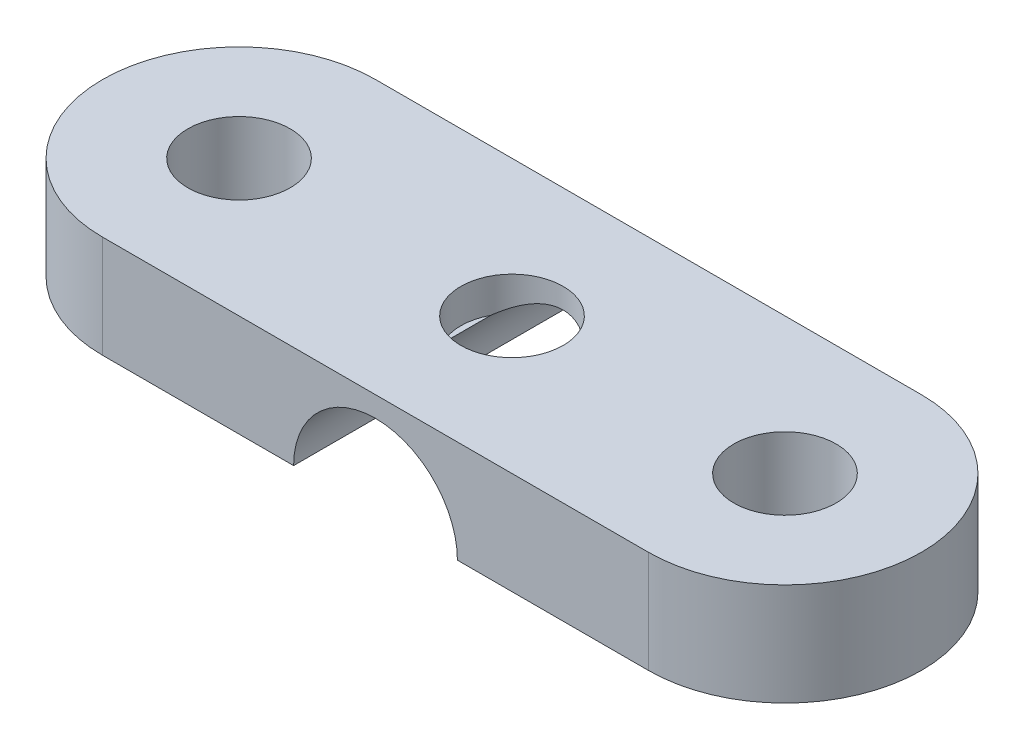
ISO-10303-21;
HEADER;
FILE_DESCRIPTION(('STEP AP214'),'2;1');
FILE_NAME('part.step','',(''),(''),'','','');
FILE_SCHEMA(('AUTOMOTIVE_DESIGN { 1 0 10303 214 1 1 1 1 }'));
ENDSEC;
DATA;
#1=APPLICATION_CONTEXT('core data for automotive mechanical design processes');
#2=APPLICATION_PROTOCOL_DEFINITION('international standard','automotive_design',2000,#1);
#3=PRODUCT_CONTEXT('',#1,'mechanical');
#4=PRODUCT('Part','Part','',(#3));
#5=PRODUCT_RELATED_PRODUCT_CATEGORY('part','',(#4));
#6=PRODUCT_DEFINITION_FORMATION('','',#4);
#7=PRODUCT_DEFINITION_CONTEXT('part definition',#1,'design');
#8=PRODUCT_DEFINITION('design','',#6,#7);
#9=PRODUCT_DEFINITION_SHAPE('','',#8);
#10=(LENGTH_UNIT() NAMED_UNIT(*) SI_UNIT(.MILLI.,.METRE.));
#11=(NAMED_UNIT(*) PLANE_ANGLE_UNIT() SI_UNIT($,.RADIAN.));
#12=(NAMED_UNIT(*) SI_UNIT($,.STERADIAN.) SOLID_ANGLE_UNIT());
#13=UNCERTAINTY_MEASURE_WITH_UNIT(LENGTH_MEASURE(1.E-05),#10,'distance_accuracy_value','');
#14=(GEOMETRIC_REPRESENTATION_CONTEXT(3) GLOBAL_UNCERTAINTY_ASSIGNED_CONTEXT((#13)) GLOBAL_UNIT_ASSIGNED_CONTEXT((#10,
#11,#12)) REPRESENTATION_CONTEXT('',''));
#15=CARTESIAN_POINT('',(0.,0.,0.));
#16=DIRECTION('',(0.,0.,1.));
#17=DIRECTION('',(1.,0.,0.));
#18=AXIS2_PLACEMENT_3D('',#15,#16,#17);
#19=CARTESIAN_POINT('',(8.,0.,0.));
#20=DIRECTION('',(0.,1.,0.));
#21=DIRECTION('',(1.,0.,0.));
#22=AXIS2_PLACEMENT_3D('',#19,#20,#21);
#23=CYLINDRICAL_SURFACE('',#22,4.00000005960464);
#24=CARTESIAN_POINT('',(8.,0.,0.));
#25=DIRECTION('',(0.,1.,0.));
#26=DIRECTION('',(1.,0.,0.));
#27=AXIS2_PLACEMENT_3D('',#24,#25,#26);
#28=CIRCLE('',#27,4.00000005960464);
#29=CARTESIAN_POINT('',(8.,0.,4.00000005960464));
#30=VERTEX_POINT('',#29);
#31=CARTESIAN_POINT('',(8.,0.,-4.00000005960464));
#32=VERTEX_POINT('',#31);
#33=EDGE_CURVE('E74',#30,#32,#28,.T.);
#34=ORIENTED_EDGE('',*,*,#33,.T.);
#35=DIRECTION('',(0.,1.,0.));
#36=VECTOR('',#35,1.);
#37=CARTESIAN_POINT('',(8.,0.,-4.00000005960464));
#38=LINE('',#37,#36);
#39=CARTESIAN_POINT('',(8.,3.,-4.00000005960464));
#40=VERTEX_POINT('',#39);
#41=EDGE_CURVE('E10',#32,#40,#38,.T.);
#42=ORIENTED_EDGE('',*,*,#41,.T.);
#43=CARTESIAN_POINT('',(8.,3.,0.));
#44=DIRECTION('',(0.,1.,0.));
#45=DIRECTION('',(1.,0.,0.));
#46=AXIS2_PLACEMENT_3D('',#43,#44,#45);
#47=CIRCLE('',#46,4.00000005960464);
#48=CARTESIAN_POINT('',(8.,3.,4.00000005960464));
#49=VERTEX_POINT('',#48);
#50=EDGE_CURVE('E82',#49,#40,#47,.T.);
#51=ORIENTED_EDGE('',*,*,#50,.F.);
#52=DIRECTION('',(0.,1.,0.));
#53=VECTOR('',#52,1.);
#54=CARTESIAN_POINT('',(8.,0.,4.00000005960464));
#55=LINE('',#54,#53);
#56=EDGE_CURVE('E265',#30,#49,#55,.T.);
#57=ORIENTED_EDGE('',*,*,#56,.F.);
#58=EDGE_LOOP('',(#34,#42,#51,#57));
#59=FACE_BOUND('',#58,.T.);
#60=ADVANCED_FACE('F15',(#59),#23,.T.);
#61=CARTESIAN_POINT('',(8.,0.,-4.));
#62=DIRECTION('',(0.,0.,-1.));
#63=DIRECTION('',(0.,-1.,0.));
#64=AXIS2_PLACEMENT_3D('',#61,#62,#63);
#65=PLANE('',#64);
#66=CARTESIAN_POINT('',(0.,0.,-4.));
#67=DIRECTION('',(0.,0.,1.));
#68=DIRECTION('',(-1.,0.,0.));
#69=AXIS2_PLACEMENT_3D('',#66,#67,#68);
#70=CIRCLE('',#69,2.4);
#71=CARTESIAN_POINT('',(2.4,0.,-4.));
#72=VERTEX_POINT('',#71);
#73=CARTESIAN_POINT('',(-2.4,0.,-4.));
#74=VERTEX_POINT('',#73);
#75=EDGE_CURVE('E317',#72,#74,#70,.T.);
#76=ORIENTED_EDGE('',*,*,#75,.T.);
#77=DIRECTION('',(1.,0.,0.));
#78=VECTOR('',#77,1.);
#79=CARTESIAN_POINT('',(0.,0.,-4.));
#80=LINE('',#79,#78);
#81=CARTESIAN_POINT('',(-8.00000011920929,0.,-4.));
#82=VERTEX_POINT('',#81);
#83=EDGE_CURVE('E376',#82,#74,#80,.T.);
#84=ORIENTED_EDGE('',*,*,#83,.F.);
#85=DIRECTION('',(0.,1.,0.));
#86=VECTOR('',#85,1.);
#87=CARTESIAN_POINT('',(-8.00000011920929,0.,-4.));
#88=LINE('',#87,#86);
#89=CARTESIAN_POINT('',(-8.00000011920929,3.,-4.));
#90=VERTEX_POINT('',#89);
#91=EDGE_CURVE('E26',#82,#90,#88,.T.);
#92=ORIENTED_EDGE('',*,*,#91,.T.);
#93=DIRECTION('',(-1.,0.,0.));
#94=VECTOR('',#93,1.);
#95=CARTESIAN_POINT('',(0.,3.,-4.));
#96=LINE('',#95,#94);
#97=EDGE_CURVE('E329',#40,#90,#96,.T.);
#98=ORIENTED_EDGE('',*,*,#97,.F.);
#99=ORIENTED_EDGE('',*,*,#41,.F.);
#100=DIRECTION('',(1.,0.,0.));
#101=VECTOR('',#100,1.);
#102=CARTESIAN_POINT('',(0.,0.,-4.));
#103=LINE('',#102,#101);
#104=EDGE_CURVE('E325',#72,#32,#103,.T.);
#105=ORIENTED_EDGE('',*,*,#104,.F.);
#106=EDGE_LOOP('',(#76,#84,#92,#98,#99,#105));
#107=FACE_BOUND('',#106,.T.);
#108=ADVANCED_FACE('F409',(#107),#65,.T.);
#109=CARTESIAN_POINT('',(-8.00000011920929,0.,2.9802322276673E-08));
#110=DIRECTION('',(0.,1.,0.));
#111=DIRECTION('',(-1.,0.,0.));
#112=AXIS2_PLACEMENT_3D('',#109,#110,#111);
#113=CYLINDRICAL_SURFACE('',#112,4.00000002980232);
#114=CARTESIAN_POINT('',(-8.00000011920929,0.,2.9802322276673E-08));
#115=DIRECTION('',(0.,1.,0.));
#116=DIRECTION('',(1.,0.,0.));
#117=AXIS2_PLACEMENT_3D('',#114,#115,#116);
#118=CIRCLE('',#117,4.00000002980232);
#119=CARTESIAN_POINT('',(-8.00000011920929,0.,4.00000005960464));
#120=VERTEX_POINT('',#119);
#121=EDGE_CURVE('E316',#82,#120,#118,.T.);
#122=ORIENTED_EDGE('',*,*,#121,.T.);
#123=DIRECTION('',(0.,1.,0.));
#124=VECTOR('',#123,1.);
#125=CARTESIAN_POINT('',(-8.00000011920929,0.,4.00000005960464));
#126=LINE('',#125,#124);
#127=CARTESIAN_POINT('',(-8.00000011920929,3.,4.00000005960464));
#128=VERTEX_POINT('',#127);
#129=EDGE_CURVE('E264',#120,#128,#126,.T.);
#130=ORIENTED_EDGE('',*,*,#129,.T.);
#131=CARTESIAN_POINT('',(-8.00000011920929,3.,2.9802322276673E-08));
#132=DIRECTION('',(0.,1.,0.));
#133=DIRECTION('',(1.,0.,0.));
#134=AXIS2_PLACEMENT_3D('',#131,#132,#133);
#135=CIRCLE('',#134,4.00000002980232);
#136=EDGE_CURVE('E94',#90,#128,#135,.T.);
#137=ORIENTED_EDGE('',*,*,#136,.F.);
#138=ORIENTED_EDGE('',*,*,#91,.F.);
#139=EDGE_LOOP('',(#122,#130,#137,#138));
#140=FACE_BOUND('',#139,.T.);
#141=ADVANCED_FACE('F398',(#140),#113,.T.);
#142=CARTESIAN_POINT('',(-8.00000011920929,0.,2.9802322276673E-08));
#143=DIRECTION('',(0.,1.,0.));
#144=DIRECTION('',(1.,0.,0.));
#145=AXIS2_PLACEMENT_3D('',#142,#143,#144);
#146=CYLINDRICAL_SURFACE('',#145,1.5);
#147=CARTESIAN_POINT('',(-8.00000011920929,3.,2.9802322276673E-08));
#148=DIRECTION('',(0.,-1.,0.));
#149=DIRECTION('',(1.,0.,0.));
#150=AXIS2_PLACEMENT_3D('',#147,#148,#149);
#151=CIRCLE('',#150,1.5);
#152=CARTESIAN_POINT('',(-9.50000011920929,3.,2.980232246037E-08));
#153=VERTEX_POINT('',#152);
#154=EDGE_CURVE('E282',#153,#153,#151,.T.);
#155=ORIENTED_EDGE('',*,*,#154,.F.);
#156=DIRECTION('',(0.,-1.,0.));
#157=VECTOR('',#156,1.);
#158=CARTESIAN_POINT('',(-9.50000011920929,0.,2.980232246037E-08));
#159=LINE('',#158,#157);
#160=CARTESIAN_POINT('',(-9.50000011920929,0.,2.980232246037E-08));
#161=VERTEX_POINT('',#160);
#162=EDGE_CURVE('E128',#153,#161,#159,.T.);
#163=ORIENTED_EDGE('',*,*,#162,.T.);
#164=CARTESIAN_POINT('',(-8.00000011920929,0.,2.9802322276673E-08));
#165=DIRECTION('',(0.,-1.,0.));
#166=DIRECTION('',(1.,0.,0.));
#167=AXIS2_PLACEMENT_3D('',#164,#165,#166);
#168=CIRCLE('',#167,1.5);
#169=EDGE_CURVE('E356',#161,#161,#168,.T.);
#170=ORIENTED_EDGE('',*,*,#169,.T.);
#171=ORIENTED_EDGE('',*,*,#162,.F.);
#172=EDGE_LOOP('',(#155,#163,#170,#171));
#173=FACE_BOUND('',#172,.T.);
#174=ADVANCED_FACE('F227',(#173),#146,.F.);
#175=CARTESIAN_POINT('',(8.,0.,0.));
#176=DIRECTION('',(0.,1.,0.));
#177=DIRECTION('',(1.,0.,0.));
#178=AXIS2_PLACEMENT_3D('',#175,#176,#177);
#179=CYLINDRICAL_SURFACE('',#178,1.5);
#180=CARTESIAN_POINT('',(8.,3.,0.));
#181=DIRECTION('',(0.,-1.,0.));
#182=DIRECTION('',(1.,0.,0.));
#183=AXIS2_PLACEMENT_3D('',#180,#181,#182);
#184=CIRCLE('',#183,1.5);
#185=CARTESIAN_POINT('',(6.5,3.,0.));
#186=VERTEX_POINT('',#185);
#187=EDGE_CURVE('E287',#186,#186,#184,.T.);
#188=ORIENTED_EDGE('',*,*,#187,.F.);
#189=DIRECTION('',(0.,-1.,0.));
#190=VECTOR('',#189,1.);
#191=CARTESIAN_POINT('',(6.5,0.,0.));
#192=LINE('',#191,#190);
#193=CARTESIAN_POINT('',(6.5,0.,0.));
#194=VERTEX_POINT('',#193);
#195=EDGE_CURVE('E40',#186,#194,#192,.T.);
#196=ORIENTED_EDGE('',*,*,#195,.T.);
#197=CARTESIAN_POINT('',(8.,0.,0.));
#198=DIRECTION('',(0.,-1.,0.));
#199=DIRECTION('',(1.,0.,0.));
#200=AXIS2_PLACEMENT_3D('',#197,#198,#199);
#201=CIRCLE('',#200,1.5);
#202=EDGE_CURVE('E366',#194,#194,#201,.T.);
#203=ORIENTED_EDGE('',*,*,#202,.T.);
#204=ORIENTED_EDGE('',*,*,#195,.F.);
#205=EDGE_LOOP('',(#188,#196,#203,#204));
#206=FACE_BOUND('',#205,.T.);
#207=ADVANCED_FACE('F397',(#206),#179,.F.);
#208=CARTESIAN_POINT('',(-4.47034831374538E-08,3.,0.));
#209=DIRECTION('',(0.,1.,0.));
#210=DIRECTION('',(1.,0.,0.));
#211=AXIS2_PLACEMENT_3D('',#208,#209,#210);
#212=PLANE('',#211);
#213=ORIENTED_EDGE('',*,*,#187,.T.);
#214=EDGE_LOOP('',(#213));
#215=FACE_BOUND('',#214,.T.);
#216=ORIENTED_EDGE('',*,*,#154,.T.);
#217=EDGE_LOOP('',(#216));
#218=FACE_BOUND('',#217,.T.);
#219=CARTESIAN_POINT('',(0.,3.,0.));
#220=DIRECTION('',(0.,-1.,0.));
#221=DIRECTION('',(-1.,0.,0.));
#222=AXIS2_PLACEMENT_3D('',#219,#220,#221);
#223=CIRCLE('',#222,1.5);
#224=CARTESIAN_POINT('',(1.5,3.,0.));
#225=VERTEX_POINT('',#224);
#226=EDGE_CURVE('E244',#225,#225,#223,.T.);
#227=ORIENTED_EDGE('',*,*,#226,.T.);
#228=EDGE_LOOP('',(#227));
#229=FACE_BOUND('',#228,.T.);
#230=ORIENTED_EDGE('',*,*,#50,.T.);
#231=ORIENTED_EDGE('',*,*,#97,.T.);
#232=ORIENTED_EDGE('',*,*,#136,.T.);
#233=DIRECTION('',(1.,0.,0.));
#234=VECTOR('',#233,1.);
#235=CARTESIAN_POINT('',(8.,3.,4.00000005960464));
#236=LINE('',#235,#234);
#237=EDGE_CURVE('E260',#128,#49,#236,.T.);
#238=ORIENTED_EDGE('',*,*,#237,.T.);
#239=EDGE_LOOP('',(#230,#231,#232,#238));
#240=FACE_BOUND('',#239,.T.);
#241=ADVANCED_FACE('F203',(#215,#218,#229,#240),#212,.T.);
#242=CARTESIAN_POINT('',(-4.47034831374538E-08,0.,0.));
#243=DIRECTION('',(0.,1.,0.));
#244=DIRECTION('',(1.,0.,0.));
#245=AXIS2_PLACEMENT_3D('',#242,#243,#244);
#246=PLANE('',#245);
#247=ORIENTED_EDGE('',*,*,#169,.F.);
#248=EDGE_LOOP('',(#247));
#249=FACE_BOUND('',#248,.T.);
#250=DIRECTION('',(0.,0.,1.));
#251=VECTOR('',#250,1.);
#252=CARTESIAN_POINT('',(-2.4,0.,-4.));
#253=LINE('',#252,#251);
#254=CARTESIAN_POINT('',(-2.4,0.,4.));
#255=VERTEX_POINT('',#254);
#256=EDGE_CURVE('E312',#74,#255,#253,.T.);
#257=ORIENTED_EDGE('',*,*,#256,.T.);
#258=DIRECTION('',(-1.,0.,0.));
#259=VECTOR('',#258,1.);
#260=CARTESIAN_POINT('',(8.,0.,4.00000005960464));
#261=LINE('',#260,#259);
#262=EDGE_CURVE('E295',#255,#120,#261,.T.);
#263=ORIENTED_EDGE('',*,*,#262,.T.);
#264=ORIENTED_EDGE('',*,*,#121,.F.);
#265=ORIENTED_EDGE('',*,*,#83,.T.);
#266=EDGE_LOOP('',(#257,#263,#264,#265));
#267=FACE_BOUND('',#266,.T.);
#268=ADVANCED_FACE('F17',(#249,#267),#246,.F.);
#269=CARTESIAN_POINT('',(0.,0.,-4.));
#270=DIRECTION('',(0.,0.,1.));
#271=DIRECTION('',(-1.,0.,0.));
#272=AXIS2_PLACEMENT_3D('',#269,#270,#271);
#273=CYLINDRICAL_SURFACE('',#272,2.4);
#274=CARTESIAN_POINT('',(1.32664991614216,2.,-0.7));
#275=CARTESIAN_POINT('',(1.31894725917453,2.00510935642993,-0.714598993234624));
#276=CARTESIAN_POINT('',(1.31101995918579,2.01030366475797,-0.729049568465323));
#277=CARTESIAN_POINT('',(1.2946928360145,2.02085756125338,-0.757692311354903));
#278=CARTESIAN_POINT('',(1.28629148169701,2.02621765634979,-0.771883419548551));
#279=CARTESIAN_POINT('',(1.2690078678638,2.0370870622359,-0.800007228026607));
#280=CARTESIAN_POINT('',(1.26012364368659,2.04259692864135,-0.813938505889663));
#281=CARTESIAN_POINT('',(1.24186625403736,2.05374858351657,-0.841543123917829));
#282=CARTESIAN_POINT('',(1.23249071059813,2.05939092309833,-0.855214668360986));
#283=CARTESIAN_POINT('',(1.21324245012647,2.07078937700965,-0.882300111996313));
#284=CARTESIAN_POINT('',(1.20336696343632,2.07654598525142,-0.89571183451936));
#285=CARTESIAN_POINT('',(1.18311087092311,2.08815371019494,-0.922278231201484));
#286=CARTESIAN_POINT('',(1.17272713146686,2.09400520921097,-0.935430348516213));
#287=CARTESIAN_POINT('',(1.15144580468288,2.10578290116029,-0.961477113409357));
#288=CARTESIAN_POINT('',(1.1405447419552,2.11170931551515,-0.974368820040482));
#289=CARTESIAN_POINT('',(1.1182234483377,2.12361431742321,-0.999898151515599));
#290=CARTESIAN_POINT('',(1.10679945957926,2.12959289976434,-1.01253249277121));
#291=CARTESIAN_POINT('',(1.08398517626738,2.14129259866115,-1.03692629314525));
#292=CARTESIAN_POINT('',(1.07261123121953,2.14701459251792,-1.04870061747784));
#293=CARTESIAN_POINT('',(1.04947512708697,2.1584179627626,-1.07186299976428));
#294=CARTESIAN_POINT('',(1.03771325363095,2.16409936544627,-1.08325132992541));
#295=CARTESIAN_POINT('',(1.0138002991353,2.17540430926419,-1.1056449533737));
#296=CARTESIAN_POINT('',(1.00164916930417,2.18102784302718,-1.11665019827926));
#297=CARTESIAN_POINT('',(0.976953869178679,2.19220094315026,-1.13827720297554));
#298=CARTESIAN_POINT('',(0.964409328220406,2.19775043227601,-1.14889857950192));
#299=CARTESIAN_POINT('',(0.938924550480593,2.20875840656865,-1.16975834791453));
#300=CARTESIAN_POINT('',(0.925983636998106,2.21421670833365,-1.17999600988998));
#301=CARTESIAN_POINT('',(0.899703758089893,2.22502484139463,-1.20008881579016));
#302=CARTESIAN_POINT('',(0.886363829249498,2.23037434714037,-1.20994287487108));
#303=CARTESIAN_POINT('',(0.859283559313272,2.24094706796996,-1.229268191525));
#304=CARTESIAN_POINT('',(0.845541989523052,2.24616978047147,-1.23873800228829));
#305=CARTESIAN_POINT('',(0.817658382125975,2.25646994838907,-1.25729763120663));
#306=CARTESIAN_POINT('',(0.803514883785719,2.26154668747054,-1.26638565203954));
#307=CARTESIAN_POINT('',(0.774333983638516,2.27170747544031,-1.28447468014086));
#308=CARTESIAN_POINT('',(0.759283249526191,2.27678405502706,-1.29345840412501));
#309=CARTESIAN_POINT('',(0.728968273440115,2.28666939920905,-1.31084070581692));
#310=CARTESIAN_POINT('',(0.713707463132583,2.29148026524577,-1.31924406881081));
#311=CARTESIAN_POINT('',(0.682978217173469,2.30082516121426,-1.33546872981339));
#312=CARTESIAN_POINT('',(0.667512744366202,2.30536123606236,-1.34329445703835));
#313=CARTESIAN_POINT('',(0.636378623628907,2.31414818773693,-1.35836297564673));
#314=CARTESIAN_POINT('',(0.620712485763141,2.31840100558135,-1.36560982158481));
#315=CARTESIAN_POINT('',(0.58605153715512,2.32742834471404,-1.38090443115733));
#316=CARTESIAN_POINT('',(0.566992769597237,2.33214723837823,-1.38884057324007));
#317=CARTESIAN_POINT('',(0.528596181494264,2.34114762382716,-1.40386815685602));
#318=CARTESIAN_POINT('',(0.509261055558564,2.34543181289488,-1.41096485925001));
#319=CARTESIAN_POINT('',(0.476476024779165,2.35226581393458,-1.4222329155547));
#320=CARTESIAN_POINT('',(0.463121818206856,2.35493207275364,-1.42661391473158));
#321=CARTESIAN_POINT('',(0.436354876283397,2.36003788308612,-1.4349966720977));
#322=CARTESIAN_POINT('',(0.42294315670674,2.36247885314368,-1.4390008069213));
#323=CARTESIAN_POINT('',(0.392725708692422,2.36771090932253,-1.44757129766013));
#324=CARTESIAN_POINT('',(0.37588214852281,2.37044428782906,-1.45204006899337));
#325=CARTESIAN_POINT('',(0.342115352881034,2.37555187745027,-1.46037841405882));
#326=CARTESIAN_POINT('',(0.325193399953035,2.37792836447012,-1.46425178874451));
#327=CARTESIAN_POINT('',(0.29127732574345,2.38231993301681,-1.47139941149948));
#328=CARTESIAN_POINT('',(0.274284139721773,2.38433696445659,-1.47467689415301));
#329=CARTESIAN_POINT('',(0.240233629592212,2.38800747732525,-1.48063344586536));
#330=CARTESIAN_POINT('',(0.223176935811874,2.38966255005268,-1.48331513510515));
#331=CARTESIAN_POINT('',(0.189007349959649,2.39260721627059,-1.48808068241138));
#332=CARTESIAN_POINT('',(0.171894836555138,2.39389801342981,-1.49016650966023));
#333=CARTESIAN_POINT('',(0.137621611462098,2.39611238006753,-1.49374105462596));
#334=CARTESIAN_POINT('',(0.120461085489929,2.39703674196006,-1.49523106086371));
#335=CARTESIAN_POINT('',(0.0860998397097828,2.3985166759963,-1.49761446806999));
#336=CARTESIAN_POINT('',(0.0688991763686549,2.39907261162276,-1.49850845706367));
#337=CARTESIAN_POINT('',(0.034465683855277,2.39981431199648,-1.49970122163266));
#338=CARTESIAN_POINT('',(0.0172328487664829,2.40000000016482,-1.49999987407349));
#339=CARTESIAN_POINT('',(-0.0171918676746709,2.39999999983557,-1.50000012562705));
#340=CARTESIAN_POINT('',(-0.0343837489620547,2.39981519345127,-1.49970314289136));
#341=CARTESIAN_POINT('',(-0.0687468347574907,2.39907677061346,-1.49851224888935));
#342=CARTESIAN_POINT('',(-0.0859180260750518,2.39852298412875,-1.49761806242271));
#343=CARTESIAN_POINT('',(-0.120231870551941,2.39704812064485,-1.49523416130012));
#344=CARTESIAN_POINT('',(-0.137374428880749,2.39612643487052,-1.4937434595603));
#345=CARTESIAN_POINT('',(-0.171623265450719,2.39391745086764,-1.49016705747533));
#346=CARTESIAN_POINT('',(-0.188729300830701,2.39262911753172,-1.48807967251867));
#347=CARTESIAN_POINT('',(-0.222897445504117,2.38968867057891,-1.48331063986717));
#348=CARTESIAN_POINT('',(-0.239959101260297,2.38803511438442,-1.48062663533374));
#349=CARTESIAN_POINT('',(-0.27403100679411,2.38436618649339,-1.47466503412943));
#350=CARTESIAN_POINT('',(-0.291040535395974,2.38234898936559,-1.4713844418988));
#351=CARTESIAN_POINT('',(-0.32500060887839,2.37795492112686,-1.4642302219223));
#352=CARTESIAN_POINT('',(-0.341950113191175,2.37557587165071,-1.46035300066852));
#353=CARTESIAN_POINT('',(-0.375783441921683,2.37046021746488,-1.45200638542393));
#354=CARTESIAN_POINT('',(-0.392665868844789,2.36772111417614,-1.44753284996309));
#355=CARTESIAN_POINT('',(-0.419088283480889,2.36314640205387,-1.44005091761705));
#356=CARTESIAN_POINT('',(-0.428700417147759,2.36142135575827,-1.43722753639307));
#357=CARTESIAN_POINT('',(-0.447899918952937,2.35785526815796,-1.43138912269425));
#358=CARTESIAN_POINT('',(-0.457486911367121,2.35601368062143,-1.42837318701913));
#359=CARTESIAN_POINT('',(-0.481057452403676,2.35133751733357,-1.4206981691444));
#360=CARTESIAN_POINT('',(-0.494994243645334,2.3484423039988,-1.41593183372516));
#361=CARTESIAN_POINT('',(-0.525049206230868,2.34192199611447,-1.4051403317677));
#362=CARTESIAN_POINT('',(-0.541131553263901,2.33825688355958,-1.39903946703423));
#363=CARTESIAN_POINT('',(-0.573102542885759,2.33062760709408,-1.38626480369915));
#364=CARTESIAN_POINT('',(-0.588989629092745,2.32666190611982,-1.37958803235243));
#365=CARTESIAN_POINT('',(-0.620565328269045,2.3184405487894,-1.36566072766272));
#366=CARTESIAN_POINT('',(-0.636251957378399,2.31418316203881,-1.35840671992118));
#367=CARTESIAN_POINT('',(-0.667422609741678,2.30538744983546,-1.34332562150828));
#368=CARTESIAN_POINT('',(-0.682904205274434,2.30084724407034,-1.33549461347735));
#369=CARTESIAN_POINT('',(-0.713661325464413,2.29149472236807,-1.3192605170901));
#370=CARTESIAN_POINT('',(-0.72893397198551,2.28668041820917,-1.31085312437529));
#371=CARTESIAN_POINT('',(-0.759268327711083,2.27678908848484,-1.29346410388819));
#372=CARTESIAN_POINT('',(-0.77432669156584,2.27171001422554,-1.2844778102954));
#373=CARTESIAN_POINT('',(-0.803508249246489,2.26154899791877,-1.26639110132609));
#374=CARTESIAN_POINT('',(-0.817645119776505,2.25647470715542,-1.25730842497557));
#375=CARTESIAN_POINT('',(-0.845517471536954,2.24617897692369,-1.23875798315731));
#376=CARTESIAN_POINT('',(-0.859254365356924,2.2409582290656,-1.2292919565423));
#377=CARTESIAN_POINT('',(-0.886327273239004,2.23038885489198,-1.20997274746252));
#378=CARTESIAN_POINT('',(-0.899664465197558,2.22504070983293,-1.20012095235344));
#379=CARTESIAN_POINT('',(-0.925940817238211,2.21423460873072,-1.18003120422645));
#380=CARTESIAN_POINT('',(-0.938880887976455,2.20877696020169,-1.16979427677636));
#381=CARTESIAN_POINT('',(-0.964365886622298,2.19776950108843,-1.14893450643173));
#382=CARTESIAN_POINT('',(-0.976911436803157,2.19221985915694,-1.13831233474374));
#383=CARTESIAN_POINT('',(-1.00161063064625,2.18104556026565,-1.11668227971473));
#384=CARTESIAN_POINT('',(-1.01376458926711,2.17542096901006,-1.10567472200517));
#385=CARTESIAN_POINT('',(-1.03768499530329,2.16411294628143,-1.08327496543064));
#386=CARTESIAN_POINT('',(-1.04945143511526,2.15842951365677,-1.07188275902751));
#387=CARTESIAN_POINT('',(-1.07259856702293,2.14702096087635,-1.04871128745013));
#388=CARTESIAN_POINT('',(-1.08397891651874,2.14129580890362,-1.03693169588165));
#389=CARTESIAN_POINT('',(-1.10679737165623,2.12959397039956,-1.01253606748874));
#390=CARTESIAN_POINT('',(-1.11821942915566,2.1236164191019,-0.999905439131453));
#391=CARTESIAN_POINT('',(-1.14053736878649,2.1117132895173,-0.974382379854928));
#392=CARTESIAN_POINT('',(-1.15143698401332,2.10578771469836,-0.961493212015476));
#393=CARTESIAN_POINT('',(-1.1727160652629,2.09401140104015,-0.935450552358587));
#394=CARTESIAN_POINT('',(-1.18309897906744,2.08816044184872,-0.922299978545288));
#395=CARTESIAN_POINT('',(-1.20335401551168,2.07655348730201,-0.895735649553234));
#396=CARTESIAN_POINT('',(-1.21322924327867,2.07079711258797,-0.882324428251699));
#397=CARTESIAN_POINT('',(-1.23247757871823,2.05939878417055,-0.855238980722899));
#398=CARTESIAN_POINT('',(-1.24185342635893,2.05375634160465,-0.841566907928145));
#399=CARTESIAN_POINT('',(-1.26011200168772,2.04260411617531,-0.813960223502074));
#400=CARTESIAN_POINT('',(-1.26899707676413,2.03709378922621,-0.800027384499484));
#401=CARTESIAN_POINT('',(-1.2862829578655,2.02622307591049,-0.771899445135829));
#402=CARTESIAN_POINT('',(-1.29468569727207,2.02086214284046,-0.757705744490475));
#403=CARTESIAN_POINT('',(-1.31101614544149,2.01030616275132,-0.729056805853065));
#404=CARTESIAN_POINT('',(-1.3189453536362,2.00511061943873,-0.714602605326772));
#405=CARTESIAN_POINT('',(-1.32664991614216,2.,-0.7));
#406=B_SPLINE_CURVE_WITH_KNOTS('',3,(#274,#275,#276,#277,#278,#279,#280,#281,#282,#283,#284,
#285,#286,#287,#288,#289,#290,#291,#292,#293,#294,#295,#296,#297,#298,#299,#300,#301,#302,#303,
#304,#305,#306,#307,#308,#309,#310,#311,#312,#313,#314,#315,#316,#317,#318,#319,#320,#321,#322,
#323,#324,#325,#326,#327,#328,#329,#330,#331,#332,#333,#334,#335,#336,#337,#338,#339,#340,#341,
#342,#343,#344,#345,#346,#347,#348,#349,#350,#351,#352,#353,#354,#355,#356,#357,#358,#359,#360,
#361,#362,#363,#364,#365,#366,#367,#368,#369,#370,#371,#372,#373,#374,#375,#376,#377,#378,#379,
#380,#381,#382,#383,#384,#385,#386,#387,#388,#389,#390,#391,#392,#393,#394,#395,#396,#397,#398,
#399,#400,#401,#402,#403,#404,#405),.UNSPECIFIED.,.F.,.F.,(4,2,2,2,2,2,2,2,2,2,2,2,2,2,2,2,2,2,
2,2,2,2,2,2,2,2,2,2,2,2,2,2,2,2,2,2,2,2,2,2,2,2,2,2,2,2,2,2,2,2,2,2,2,2,2,2,2,2,2,2,2,2,2,2,2,
4),(0.,0.0518347863888912,0.10384781792851,0.156091155515084,0.208616174918459,
0.261473430223464,0.314712528739165,0.36838201860358,0.422529289940467,0.474546729102036,
0.526526687636772,0.578513187314114,0.63055023317711,0.682681702139878,0.734951233199491,
0.787402120618446,0.840077211348166,0.894811052522283,0.949020002872601,1.00275717347696,
1.05607708522117,1.11958718588546,1.18267541192221,1.2255846248301,1.26820200501227,
1.3211062247546,1.37365726780448,1.42591393572553,1.47793602830438,1.52978415698649,
1.58151954465169,1.6332038148252,1.68489877383798,1.73647079810618,1.78806660393886,
1.83974814336607,1.89157706098211,1.94361447762219,1.99592078322238,2.04855544220437,
2.10157681423871,2.13207165422933,2.16272187093077,2.20774689124197,2.26049402493397,
2.31353191031849,2.36691748918416,2.42070659912104,2.47495383165681,2.52971240816834,
2.5823610543422,2.63479300416528,2.68705115259048,2.73917882376209,2.79121966782582,
2.84321755372096,2.89521645923847,2.94726035970782,3.00139513984404,3.05505564941513,
3.10828932915893,3.16114476951197,3.21367161096466,3.26592043094891,3.31794261813871,
3.36979023541322),.UNSPECIFIED.);
#407=CARTESIAN_POINT('',(1.32664991614216,2.,-0.7));
#408=VERTEX_POINT('',#407);
#409=CARTESIAN_POINT('',(-1.32664991614216,2.,-0.7));
#410=VERTEX_POINT('',#409);
#411=EDGE_CURVE('E155',#408,#410,#406,.T.);
#412=ORIENTED_EDGE('',*,*,#411,.T.);
#413=DIRECTION('',(0.,0.,1.));
#414=VECTOR('',#413,1.);
#415=CARTESIAN_POINT('',(-1.32664991614216,2.,-4.));
#416=LINE('',#415,#414);
#417=CARTESIAN_POINT('',(-1.32664991614216,2.,0.7));
#418=VERTEX_POINT('',#417);
#419=EDGE_CURVE('E145',#410,#418,#416,.T.);
#420=ORIENTED_EDGE('',*,*,#419,.T.);
#421=CARTESIAN_POINT('',(-1.32664991614216,2.,0.7));
#422=CARTESIAN_POINT('',(-1.31894725917482,2.00510935642974,0.714598993234082));
#423=CARTESIAN_POINT('',(-1.31101995918637,2.0103036647576,0.729049568464238));
#424=CARTESIAN_POINT('',(-1.29469283601557,2.02085756125269,0.757692311352888));
#425=CARTESIAN_POINT('',(-1.28629148169829,2.02621765634897,0.771883419546146));
#426=CARTESIAN_POINT('',(-1.26900786786542,2.03708706223489,0.800007228023582));
#427=CARTESIAN_POINT('',(-1.26012364368834,2.04259692864027,0.813938505886405));
#428=CARTESIAN_POINT('',(-1.24186625403929,2.05374858351541,0.841543123914261));
#429=CARTESIAN_POINT('',(-1.2324907106001,2.05939092309715,0.85521466835734));
#430=CARTESIAN_POINT('',(-1.21324245012846,2.07078937700849,0.882300111992666));
#431=CARTESIAN_POINT('',(-1.20336696343827,2.07654598525029,0.895711834515787));
#432=CARTESIAN_POINT('',(-1.1831108709249,2.08815371019393,0.922278231198222));
#433=CARTESIAN_POINT('',(-1.17272713146853,2.09400520921003,0.935430348513182));
#434=CARTESIAN_POINT('',(-1.15144580468421,2.10578290115956,0.961477113406943));
#435=CARTESIAN_POINT('',(-1.14054474195632,2.11170931551455,0.974368820038449));
#436=CARTESIAN_POINT('',(-1.11822344833831,2.12361431742289,0.999898151514505));
#437=CARTESIAN_POINT('',(-1.10679945957958,2.12959289976418,1.01253249277067));
#438=CARTESIAN_POINT('',(-1.08398517626802,2.14129259866082,1.03692629314478));
#439=CARTESIAN_POINT('',(-1.07261123122082,2.14701459251727,1.0487006174769));
#440=CARTESIAN_POINT('',(-1.04947512708937,2.15841796276143,1.07186299976255));
#441=CARTESIAN_POINT('',(-1.0377132536338,2.1640993654449,1.08325132992334));
#442=CARTESIAN_POINT('',(-1.01380029913891,2.17540430926251,1.10564495337108));
#443=CARTESIAN_POINT('',(-1.00164916930806,2.18102784302539,1.11665019827644));
#444=CARTESIAN_POINT('',(-0.976953869182955,2.19220094314835,1.13827720297245));
#445=CARTESIAN_POINT('',(-0.964409328224783,2.19775043227408,1.14889857949876));
#446=CARTESIAN_POINT('',(-0.938924550484992,2.20875840656678,1.16975834791137));
#447=CARTESIAN_POINT('',(-0.92598363700242,2.21421670833184,1.17999600988688));
#448=CARTESIAN_POINT('',(-0.899703758093849,2.22502484139303,1.20008881578734));
#449=CARTESIAN_POINT('',(-0.886363829253177,2.23037434713891,1.20994287486846));
#450=CARTESIAN_POINT('',(-0.859283559316206,2.24094706796884,1.22926819152291));
#451=CARTESIAN_POINT('',(-0.845541989525515,2.24616978047054,1.23873800228653));
#452=CARTESIAN_POINT('',(-0.817658382127305,2.2564699483886,1.25729763120568));
#453=CARTESIAN_POINT('',(-0.803514883786384,2.2615466874703,1.26638565203907));
#454=CARTESIAN_POINT('',(-0.774333983638514,2.27170747544031,1.2844746801409));
#455=CARTESIAN_POINT('',(-0.759283249526205,2.27678405502706,1.29345840412511));
#456=CARTESIAN_POINT('',(-0.728968273440148,2.28666939920904,1.31084070581711));
#457=CARTESIAN_POINT('',(-0.713707463132621,2.29148026524576,1.31924406881103));
#458=CARTESIAN_POINT('',(-0.682978217173515,2.30082516121424,1.33546872981365));
#459=CARTESIAN_POINT('',(-0.667512744366251,2.30536123606234,1.34329445703862));
#460=CARTESIAN_POINT('',(-0.636378623628958,2.31414818773692,1.35836297564701));
#461=CARTESIAN_POINT('',(-0.620712485763191,2.31840100558134,1.36560982158508));
#462=CARTESIAN_POINT('',(-0.586051537155167,2.32742834471403,1.38090443115757));
#463=CARTESIAN_POINT('',(-0.566992769597281,2.33214723837822,1.38884057324029));
#464=CARTESIAN_POINT('',(-0.52859618149429,2.34114762382716,1.40386815685614));
#465=CARTESIAN_POINT('',(-0.509261055558576,2.34543181289488,1.41096485925007));
#466=CARTESIAN_POINT('',(-0.476476024778757,2.35226581393466,1.4222329155548));
#467=CARTESIAN_POINT('',(-0.463121818206034,2.3549320727538,1.42661391473178));
#468=CARTESIAN_POINT('',(-0.436354876281824,2.36003788308642,1.43499667209806));
#469=CARTESIAN_POINT('',(-0.42294315670483,2.36247885314402,1.43900080692174));
#470=CARTESIAN_POINT('',(-0.392725708689851,2.36771090932296,1.44757129766072));
#471=CARTESIAN_POINT('',(-0.375882148519916,2.37044428782952,1.45204006899403));
#472=CARTESIAN_POINT('',(-0.342115352877614,2.37555187745076,1.4603784140596));
#473=CARTESIAN_POINT('',(-0.325193399949413,2.37792836447062,1.46425178874534));
#474=CARTESIAN_POINT('',(-0.291277325739539,2.38231993301729,1.47139941150037));
#475=CARTESIAN_POINT('',(-0.274284139717776,2.38433696445705,1.47467689415393));
#476=CARTESIAN_POINT('',(-0.240233629588161,2.38800747732566,1.48063344586628));
#477=CARTESIAN_POINT('',(-0.223176935807855,2.38966255005306,1.48331513510607));
#478=CARTESIAN_POINT('',(-0.189007349955815,2.39260721627089,1.48808068241226));
#479=CARTESIAN_POINT('',(-0.171894836551457,2.39389801343007,1.49016650966108));
#480=CARTESIAN_POINT('',(-0.137621611458841,2.39611238006771,1.4937410546267));
#481=CARTESIAN_POINT('',(-0.120461085486943,2.3970367419602,1.4952310608644));
#482=CARTESIAN_POINT('',(-0.0860998397074599,2.39851667599638,1.49761446807053));
#483=CARTESIAN_POINT('',(-0.0688991763667241,2.39907261162281,1.49850845706412));
#484=CARTESIAN_POINT('',(-0.0344656838542501,2.39981431199649,1.4997012216329));
#485=CARTESIAN_POINT('',(-0.0172328487659678,2.40000000016482,1.4999998740736));
#486=CARTESIAN_POINT('',(0.0171918676750326,2.39999999983557,1.50000012562694));
#487=CARTESIAN_POINT('',(0.0343837489627748,2.39981519345126,1.49970314289113));
#488=CARTESIAN_POINT('',(0.0687468347588383,2.39907677061343,1.4985122488889));
#489=CARTESIAN_POINT('',(0.0859180260766687,2.39852298412869,1.49761806242218));
#490=CARTESIAN_POINT('',(0.120231870554007,2.39704812064475,1.49523416129945));
#491=CARTESIAN_POINT('',(0.137374428882995,2.39612643487039,1.49374345955958));
#492=CARTESIAN_POINT('',(0.171623265453238,2.39391745086746,1.49016705747451));
#493=CARTESIAN_POINT('',(0.188729300833314,2.39262911753152,1.48807967251783));
#494=CARTESIAN_POINT('',(0.222897445506828,2.38968867057866,1.48331063986629));
#495=CARTESIAN_POINT('',(0.239959101263013,2.38803511438415,1.48062663533286));
#496=CARTESIAN_POINT('',(0.274031006796747,2.38436618649309,1.47466503412858));
#497=CARTESIAN_POINT('',(0.291040535398527,2.38234898936528,1.47138444189797));
#498=CARTESIAN_POINT('',(0.325000608880688,2.37795492112655,1.46423022192155));
#499=CARTESIAN_POINT('',(0.341950113193303,2.3755758716504,1.46035300066783));
#500=CARTESIAN_POINT('',(0.375783441923383,2.37046021746461,1.45200638542338));
#501=CARTESIAN_POINT('',(0.392665868846234,2.3677211141759,1.44753284996262));
#502=CARTESIAN_POINT('',(0.419088283481893,2.36314640205369,1.44005091761672));
#503=CARTESIAN_POINT('',(0.428700417148579,2.36142135575812,1.4372275363928));
#504=CARTESIAN_POINT('',(0.44789991895336,2.35785526815787,1.43138912269411));
#505=CARTESIAN_POINT('',(0.457486911367332,2.35601368062139,1.42837318701906));
#506=CARTESIAN_POINT('',(0.481057452404035,2.3513375173335,1.42069816914429));
#507=CARTESIAN_POINT('',(0.494994243646047,2.34844230399865,1.41593183372493));
#508=CARTESIAN_POINT('',(0.52504920623222,2.34192199611417,1.40514033176726));
#509=CARTESIAN_POINT('',(0.54113155326554,2.33825688355921,1.39903946703369));
#510=CARTESIAN_POINT('',(0.573102542887827,2.33062760709357,1.38626480369848));
#511=CARTESIAN_POINT('',(0.588989629094957,2.32666190611927,1.37958803235171));
#512=CARTESIAN_POINT('',(0.620565328271405,2.31844054878877,1.36566072766194));
#513=CARTESIAN_POINT('',(0.636251957380764,2.31418316203816,1.3584067199204));
#514=CARTESIAN_POINT('',(0.667422609743915,2.30538744983481,1.34332562150755));
#515=CARTESIAN_POINT('',(0.682904205276541,2.30084724406972,1.33549461347666));
#516=CARTESIAN_POINT('',(0.713661325466125,2.29149472236754,1.31926051708954));
#517=CARTESIAN_POINT('',(0.728933971986959,2.2866804182087,1.31085312437482));
#518=CARTESIAN_POINT('',(0.759268327711867,2.27678908848458,1.29346410388793));
#519=CARTESIAN_POINT('',(0.774326691566225,2.2717100142254,1.28447781029527));
#520=CARTESIAN_POINT('',(0.803508249246373,2.26154899791881,1.26639110132605));
#521=CARTESIAN_POINT('',(0.817645119776281,2.2564747071555,1.25730842497547));
#522=CARTESIAN_POINT('',(0.84551747153655,2.24617897692384,1.23875798315713));
#523=CARTESIAN_POINT('',(0.85925436535645,2.24095822906578,1.22929195654209));
#524=CARTESIAN_POINT('',(0.886327273238416,2.23038885489221,1.20997274746226));
#525=CARTESIAN_POINT('',(0.899664465196928,2.22504070983318,1.20012095235317));
#526=CARTESIAN_POINT('',(0.925940817237525,2.21423460873101,1.18003120422614));
#527=CARTESIAN_POINT('',(0.938880887975755,2.20877696020199,1.16979427677605));
#528=CARTESIAN_POINT('',(0.9643658866216,2.19776950108873,1.14893450643142));
#529=CARTESIAN_POINT('',(0.976911436802475,2.19221985915724,1.13831233474344));
#530=CARTESIAN_POINT('',(1.00161063064563,2.18104556026593,1.11668227971446));
#531=CARTESIAN_POINT('',(1.01376458926653,2.17542096901033,1.10567472200491));
#532=CARTESIAN_POINT('',(1.03768499530282,2.16411294628165,1.08327496543043));
#533=CARTESIAN_POINT('',(1.04945143511487,2.15842951365696,1.07188275902733));
#534=CARTESIAN_POINT('',(1.07259856702271,2.14702096087645,1.04871128745003));
#535=CARTESIAN_POINT('',(1.08397891651863,2.14129580890368,1.03693169588161));
#536=CARTESIAN_POINT('',(1.106797371656,2.12959397039968,1.01253606748914));
#537=CARTESIAN_POINT('',(1.11821942915522,2.12361641910213,0.99990543913225));
#538=CARTESIAN_POINT('',(1.14053736878568,2.11171328951774,0.974382379856407));
#539=CARTESIAN_POINT('',(1.15143698401235,2.10578771469889,0.961493212017235));
#540=CARTESIAN_POINT('',(1.17271606526169,2.09401140104083,0.935450552360794));
#541=CARTESIAN_POINT('',(1.18309897906614,2.08816044184946,0.922299978547664));
#542=CARTESIAN_POINT('',(1.20335401551026,2.07655348730284,0.895735649555836));
#543=CARTESIAN_POINT('',(1.21322924327722,2.07079711258881,0.882324428254356));
#544=CARTESIAN_POINT('',(1.23247757871679,2.05939878417141,0.855238980725555));
#545=CARTESIAN_POINT('',(1.24185342635752,2.0537563416055,0.841566907930743));
#546=CARTESIAN_POINT('',(1.26011200168644,2.0426041161761,0.813960223504446));
#547=CARTESIAN_POINT('',(1.26899707676294,2.03709378922695,0.800027384501686));
#548=CARTESIAN_POINT('',(1.28628295786456,2.02622307591109,0.77189944513758));
#549=CARTESIAN_POINT('',(1.29468569727129,2.02086214284096,0.757705744491942));
#550=CARTESIAN_POINT('',(1.31101614544107,2.0103061627516,0.729056805853855));
#551=CARTESIAN_POINT('',(1.31894535363599,2.00511061943887,0.714602605327166));
#552=CARTESIAN_POINT('',(1.32664991614216,2.,0.7));
#553=B_SPLINE_CURVE_WITH_KNOTS('',3,(#421,#422,#423,#424,#425,#426,#427,#428,#429,#430,#431,
#432,#433,#434,#435,#436,#437,#438,#439,#440,#441,#442,#443,#444,#445,#446,#447,#448,#449,#450,
#451,#452,#453,#454,#455,#456,#457,#458,#459,#460,#461,#462,#463,#464,#465,#466,#467,#468,#469,
#470,#471,#472,#473,#474,#475,#476,#477,#478,#479,#480,#481,#482,#483,#484,#485,#486,#487,#488,
#489,#490,#491,#492,#493,#494,#495,#496,#497,#498,#499,#500,#501,#502,#503,#504,#505,#506,#507,
#508,#509,#510,#511,#512,#513,#514,#515,#516,#517,#518,#519,#520,#521,#522,#523,#524,#525,#526,
#527,#528,#529,#530,#531,#532,#533,#534,#535,#536,#537,#538,#539,#540,#541,#542,#543,#544,#545,
#546,#547,#548,#549,#550,#551,#552),.UNSPECIFIED.,.F.,.F.,(4,2,2,2,2,2,2,2,2,2,2,2,2,2,2,2,2,2,
2,2,2,2,2,2,2,2,2,2,2,2,2,2,2,2,2,2,2,2,2,2,2,2,2,2,2,2,2,2,2,2,2,2,2,2,2,2,2,2,2,2,2,2,2,2,2,
4),(0.,0.0518347863869653,0.103847817925211,0.156091155510961,0.208616174914062,
0.261473430219339,0.314712528735852,0.36838201860161,0.422529289940372,0.474546729099415,
0.526526687632343,0.578513187308598,0.630550233171231,0.682681702134365,0.734951233195079,
0.787402120615864,0.840077211348143,0.894811052522302,0.949020002872646,1.00275717347702,
1.05607708522122,1.11958718588549,1.18267541192222,1.22558462483139,1.26820200501461,
1.32110622475793,1.37365726780843,1.42591393572974,1.47793602830848,1.52978415699012,
1.58151954465448,1.63320381482681,1.68489877383804,1.73647079810732,1.78806660394082,
1.83974814336859,1.89157706098492,1.94361447762503,1.99592078322496,2.04855544220642,
2.10157681423994,2.13207165422997,2.16272187093074,2.20774689124308,2.26049402493601,
2.31353191032101,2.3669174891867,2.42070659912317,2.47495383165809,2.52971240816834,
2.58236105434198,2.63479300416492,2.68705115259004,2.73917882376162,2.79121966782537,
2.84321755372059,2.89521645923821,2.94726035970771,3.00139513984257,3.05505564941268,
3.10828932915589,3.16114476950873,3.21367161096162,3.26592043094647,3.31794261813727,
3.36979023541318),.UNSPECIFIED.);
#554=CARTESIAN_POINT('',(1.32664991614216,2.,0.7));
#555=VERTEX_POINT('',#554);
#556=EDGE_CURVE('E173',#418,#555,#553,.T.);
#557=ORIENTED_EDGE('',*,*,#556,.T.);
#558=DIRECTION('',(0.,0.,-1.));
#559=VECTOR('',#558,1.);
#560=CARTESIAN_POINT('',(1.32664991614216,2.,-4.));
#561=LINE('',#560,#559);
#562=EDGE_CURVE('E162',#555,#408,#561,.T.);
#563=ORIENTED_EDGE('',*,*,#562,.T.);
#564=EDGE_LOOP('',(#412,#420,#557,#563));
#565=FACE_BOUND('',#564,.T.);
#566=ORIENTED_EDGE('',*,*,#75,.F.);
#567=DIRECTION('',(0.,0.,-1.));
#568=VECTOR('',#567,1.);
#569=CARTESIAN_POINT('',(2.4,0.,-4.));
#570=LINE('',#569,#568);
#571=CARTESIAN_POINT('',(2.4,0.,4.));
#572=VERTEX_POINT('',#571);
#573=EDGE_CURVE('E300',#572,#72,#570,.T.);
#574=ORIENTED_EDGE('',*,*,#573,.F.);
#575=CARTESIAN_POINT('',(0.,0.,4.00000005960464));
#576=DIRECTION('',(0.,0.,-1.));
#577=DIRECTION('',(-1.,0.,0.));
#578=AXIS2_PLACEMENT_3D('',#575,#576,#577);
#579=CIRCLE('',#578,2.4);
#580=EDGE_CURVE('E154',#255,#572,#579,.T.);
#581=ORIENTED_EDGE('',*,*,#580,.F.);
#582=ORIENTED_EDGE('',*,*,#256,.F.);
#583=EDGE_LOOP('',(#566,#574,#581,#582));
#584=FACE_BOUND('',#583,.T.);
#585=ADVANCED_FACE('F159',(#565,#584),#273,.F.);
#586=CARTESIAN_POINT('',(-4.47034831374538E-08,0.,0.));
#587=DIRECTION('',(0.,1.,0.));
#588=DIRECTION('',(1.,0.,0.));
#589=AXIS2_PLACEMENT_3D('',#586,#587,#588);
#590=PLANE('',#589);
#591=ORIENTED_EDGE('',*,*,#202,.F.);
#592=EDGE_LOOP('',(#591));
#593=FACE_BOUND('',#592,.T.);
#594=ORIENTED_EDGE('',*,*,#573,.T.);
#595=ORIENTED_EDGE('',*,*,#104,.T.);
#596=ORIENTED_EDGE('',*,*,#33,.F.);
#597=DIRECTION('',(-1.,0.,0.));
#598=VECTOR('',#597,1.);
#599=CARTESIAN_POINT('',(8.,0.,4.00000005960464));
#600=LINE('',#599,#598);
#601=EDGE_CURVE('E339',#30,#572,#600,.T.);
#602=ORIENTED_EDGE('',*,*,#601,.T.);
#603=EDGE_LOOP('',(#594,#595,#596,#602));
#604=FACE_BOUND('',#603,.T.);
#605=ADVANCED_FACE('F200',(#593,#604),#590,.F.);
#606=CARTESIAN_POINT('',(-8.00000011920929,0.,4.00000005960464));
#607=DIRECTION('',(0.,0.,1.));
#608=DIRECTION('',(1.,0.,0.));
#609=AXIS2_PLACEMENT_3D('',#606,#607,#608);
#610=PLANE('',#609);
#611=ORIENTED_EDGE('',*,*,#580,.T.);
#612=ORIENTED_EDGE('',*,*,#601,.F.);
#613=ORIENTED_EDGE('',*,*,#56,.T.);
#614=ORIENTED_EDGE('',*,*,#237,.F.);
#615=ORIENTED_EDGE('',*,*,#129,.F.);
#616=ORIENTED_EDGE('',*,*,#262,.F.);
#617=EDGE_LOOP('',(#611,#612,#613,#614,#615,#616));
#618=FACE_BOUND('',#617,.T.);
#619=ADVANCED_FACE('F415',(#618),#610,.T.);
#620=CARTESIAN_POINT('',(0.,2.,0.));
#621=DIRECTION('',(0.,1.,0.));
#622=DIRECTION('',(1.,0.,0.));
#623=AXIS2_PLACEMENT_3D('',#620,#621,#622);
#624=PLANE('',#623);
#625=ORIENTED_EDGE('',*,*,#419,.F.);
#626=CARTESIAN_POINT('',(0.,2.,0.));
#627=DIRECTION('',(0.,-1.,0.));
#628=DIRECTION('',(-1.,0.,0.));
#629=AXIS2_PLACEMENT_3D('',#626,#627,#628);
#630=CIRCLE('',#629,1.5);
#631=EDGE_CURVE('E149',#418,#410,#630,.T.);
#632=ORIENTED_EDGE('',*,*,#631,.F.);
#633=EDGE_LOOP('',(#625,#632));
#634=FACE_BOUND('',#633,.T.);
#635=ADVANCED_FACE('F147',(#634),#624,.T.);
#636=CARTESIAN_POINT('',(0.,3.,0.));
#637=DIRECTION('',(0.,-1.,0.));
#638=DIRECTION('',(-1.,0.,0.));
#639=AXIS2_PLACEMENT_3D('',#636,#637,#638);
#640=CYLINDRICAL_SURFACE('',#639,1.5);
#641=ORIENTED_EDGE('',*,*,#226,.F.);
#642=DIRECTION('',(0.,-1.,0.));
#643=VECTOR('',#642,1.);
#644=CARTESIAN_POINT('',(1.5,3.,0.));
#645=LINE('',#644,#643);
#646=CARTESIAN_POINT('',(1.5,2.,0.));
#647=VERTEX_POINT('',#646);
#648=EDGE_CURVE('E181',#225,#647,#645,.T.);
#649=ORIENTED_EDGE('',*,*,#648,.T.);
#650=CARTESIAN_POINT('',(0.,2.,0.));
#651=DIRECTION('',(0.,-1.,0.));
#652=DIRECTION('',(-1.,0.,0.));
#653=AXIS2_PLACEMENT_3D('',#650,#651,#652);
#654=CIRCLE('',#653,1.5);
#655=EDGE_CURVE('E232',#647,#555,#654,.T.);
#656=ORIENTED_EDGE('',*,*,#655,.T.);
#657=ORIENTED_EDGE('',*,*,#556,.F.);
#658=ORIENTED_EDGE('',*,*,#631,.T.);
#659=ORIENTED_EDGE('',*,*,#411,.F.);
#660=CARTESIAN_POINT('',(0.,2.,0.));
#661=DIRECTION('',(0.,-1.,0.));
#662=DIRECTION('',(-1.,0.,0.));
#663=AXIS2_PLACEMENT_3D('',#660,#661,#662);
#664=CIRCLE('',#663,1.5);
#665=EDGE_CURVE('E217',#408,#647,#664,.T.);
#666=ORIENTED_EDGE('',*,*,#665,.T.);
#667=ORIENTED_EDGE('',*,*,#648,.F.);
#668=EDGE_LOOP('',(#641,#649,#656,#657,#658,#659,#666,#667));
#669=FACE_BOUND('',#668,.T.);
#670=ADVANCED_FACE('F171',(#669),#640,.F.);
#671=CARTESIAN_POINT('',(0.,2.,0.));
#672=DIRECTION('',(0.,1.,0.));
#673=DIRECTION('',(1.,0.,0.));
#674=AXIS2_PLACEMENT_3D('',#671,#672,#673);
#675=PLANE('',#674);
#676=ORIENTED_EDGE('',*,*,#562,.F.);
#677=ORIENTED_EDGE('',*,*,#655,.F.);
#678=ORIENTED_EDGE('',*,*,#665,.F.);
#679=EDGE_LOOP('',(#676,#677,#678));
#680=FACE_BOUND('',#679,.T.);
#681=ADVANCED_FACE('F201',(#680),#675,.T.);
#682=CLOSED_SHELL('',(#60,#108,#141,#174,#207,#241,#268,#585,#605,#619,#635,#670,#681));
#683=MANIFOLD_SOLID_BREP('B1',#682);
#684=ADVANCED_BREP_SHAPE_REPRESENTATION('',(#18,#683),#14);
#685=SHAPE_DEFINITION_REPRESENTATION(#9,#684);
ENDSEC;
END-ISO-10303-21;
